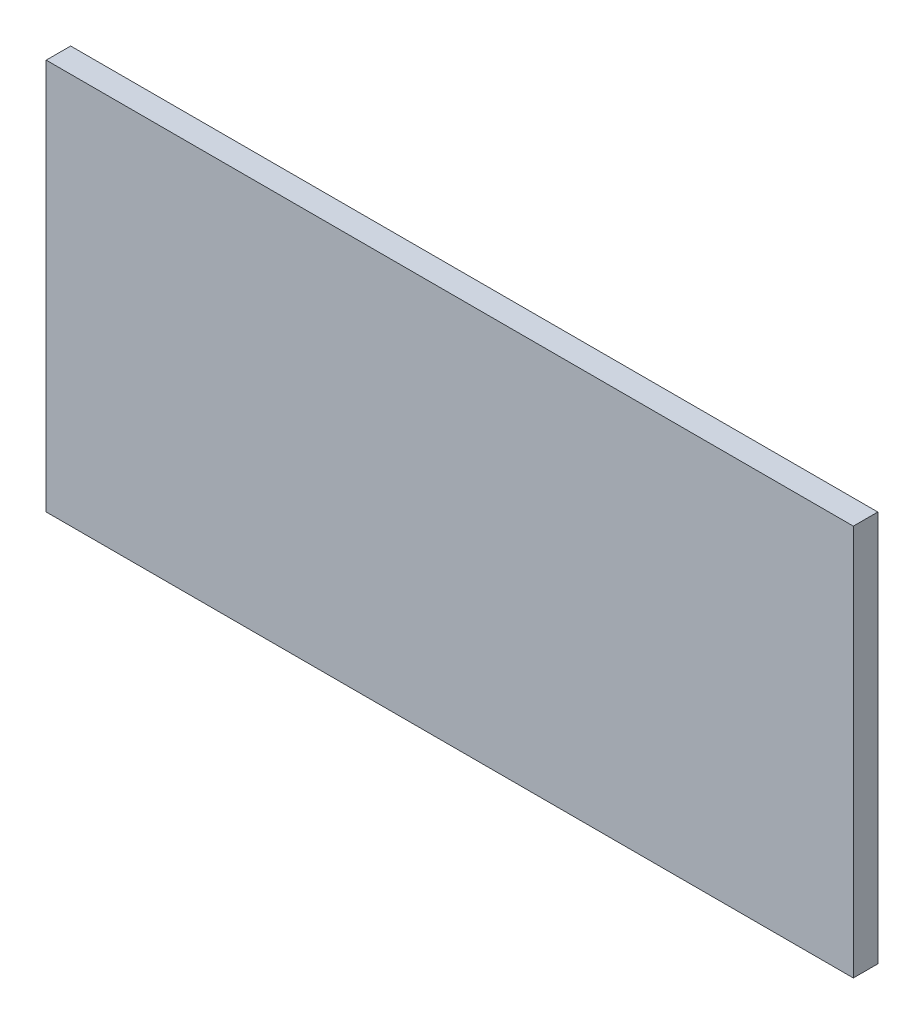
ISO-10303-21;
HEADER;
FILE_DESCRIPTION(('STEP AP214'),'2;1');
FILE_NAME('part.step','',(''),(''),'','','');
FILE_SCHEMA(('AUTOMOTIVE_DESIGN { 1 0 10303 214 1 1 1 1 }'));
ENDSEC;
DATA;
#1=APPLICATION_CONTEXT('core data for automotive mechanical design processes');
#2=APPLICATION_PROTOCOL_DEFINITION('international standard','automotive_design',2000,#1);
#3=PRODUCT_CONTEXT('',#1,'mechanical');
#4=PRODUCT('Part','Part','',(#3));
#5=PRODUCT_RELATED_PRODUCT_CATEGORY('part','',(#4));
#6=PRODUCT_DEFINITION_FORMATION('','',#4);
#7=PRODUCT_DEFINITION_CONTEXT('part definition',#1,'design');
#8=PRODUCT_DEFINITION('design','',#6,#7);
#9=PRODUCT_DEFINITION_SHAPE('','',#8);
#10=(LENGTH_UNIT() NAMED_UNIT(*) SI_UNIT(.MILLI.,.METRE.));
#11=(NAMED_UNIT(*) PLANE_ANGLE_UNIT() SI_UNIT($,.RADIAN.));
#12=(NAMED_UNIT(*) SI_UNIT($,.STERADIAN.) SOLID_ANGLE_UNIT());
#13=UNCERTAINTY_MEASURE_WITH_UNIT(LENGTH_MEASURE(1.E-05),#10,'distance_accuracy_value','');
#14=(GEOMETRIC_REPRESENTATION_CONTEXT(3) GLOBAL_UNCERTAINTY_ASSIGNED_CONTEXT((#13)) GLOBAL_UNIT_ASSIGNED_CONTEXT((#10,
#11,#12)) REPRESENTATION_CONTEXT('',''));
#15=CARTESIAN_POINT('',(0.,0.,0.));
#16=DIRECTION('',(0.,0.,1.));
#17=DIRECTION('',(1.,0.,0.));
#18=AXIS2_PLACEMENT_3D('',#15,#16,#17);
#19=CARTESIAN_POINT('',(66.,0.,2.));
#20=DIRECTION('',(0.,-1.,0.));
#21=DIRECTION('',(1.,0.,0.));
#22=AXIS2_PLACEMENT_3D('',#19,#20,#21);
#23=PLANE('',#22);
#24=DIRECTION('',(-1.,0.,0.));
#25=VECTOR('',#24,1.);
#26=CARTESIAN_POINT('',(66.,0.,0.));
#27=LINE('',#26,#25);
#28=CARTESIAN_POINT('',(66.,0.,0.));
#29=VERTEX_POINT('',#28);
#30=CARTESIAN_POINT('',(0.,0.,0.));
#31=VERTEX_POINT('',#30);
#32=EDGE_CURVE('E56',#29,#31,#27,.T.);
#33=ORIENTED_EDGE('',*,*,#32,.F.);
#34=DIRECTION('',(0.,0.,-1.));
#35=VECTOR('',#34,1.);
#36=CARTESIAN_POINT('',(66.,0.,2.));
#37=LINE('',#36,#35);
#38=CARTESIAN_POINT('',(66.,0.,2.));
#39=VERTEX_POINT('',#38);
#40=EDGE_CURVE('E31',#39,#29,#37,.T.);
#41=ORIENTED_EDGE('',*,*,#40,.F.);
#42=DIRECTION('',(-1.,0.,0.));
#43=VECTOR('',#42,1.);
#44=CARTESIAN_POINT('',(66.,0.,2.));
#45=LINE('',#44,#43);
#46=CARTESIAN_POINT('',(0.,0.,2.));
#47=VERTEX_POINT('',#46);
#48=EDGE_CURVE('E58',#39,#47,#45,.T.);
#49=ORIENTED_EDGE('',*,*,#48,.T.);
#50=DIRECTION('',(0.,0.,-1.));
#51=VECTOR('',#50,1.);
#52=CARTESIAN_POINT('',(0.,0.,2.));
#53=LINE('',#52,#51);
#54=EDGE_CURVE('E11',#47,#31,#53,.T.);
#55=ORIENTED_EDGE('',*,*,#54,.T.);
#56=EDGE_LOOP('',(#33,#41,#49,#55));
#57=FACE_BOUND('',#56,.T.);
#58=ADVANCED_FACE('F17',(#57),#23,.T.);
#59=CARTESIAN_POINT('',(0.,0.,2.));
#60=DIRECTION('',(-1.,0.,0.));
#61=DIRECTION('',(0.,-1.,0.));
#62=AXIS2_PLACEMENT_3D('',#59,#60,#61);
#63=PLANE('',#62);
#64=DIRECTION('',(0.,1.,0.));
#65=VECTOR('',#64,1.);
#66=CARTESIAN_POINT('',(0.,0.,0.));
#67=LINE('',#66,#65);
#68=CARTESIAN_POINT('',(0.,32.,0.));
#69=VERTEX_POINT('',#68);
#70=EDGE_CURVE('E63',#31,#69,#67,.T.);
#71=ORIENTED_EDGE('',*,*,#70,.F.);
#72=ORIENTED_EDGE('',*,*,#54,.F.);
#73=DIRECTION('',(0.,1.,0.));
#74=VECTOR('',#73,1.);
#75=CARTESIAN_POINT('',(0.,0.,2.));
#76=LINE('',#75,#74);
#77=CARTESIAN_POINT('',(0.,32.,2.));
#78=VERTEX_POINT('',#77);
#79=EDGE_CURVE('E81',#47,#78,#76,.T.);
#80=ORIENTED_EDGE('',*,*,#79,.T.);
#81=DIRECTION('',(0.,0.,-1.));
#82=VECTOR('',#81,1.);
#83=CARTESIAN_POINT('',(0.,32.,2.));
#84=LINE('',#83,#82);
#85=EDGE_CURVE('E24',#78,#69,#84,.T.);
#86=ORIENTED_EDGE('',*,*,#85,.T.);
#87=EDGE_LOOP('',(#71,#72,#80,#86));
#88=FACE_BOUND('',#87,.T.);
#89=ADVANCED_FACE('F64',(#88),#63,.T.);
#90=CARTESIAN_POINT('',(0.,32.,2.));
#91=DIRECTION('',(0.,1.,0.));
#92=DIRECTION('',(0.,0.,1.));
#93=AXIS2_PLACEMENT_3D('',#90,#91,#92);
#94=PLANE('',#93);
#95=DIRECTION('',(1.,0.,0.));
#96=VECTOR('',#95,1.);
#97=CARTESIAN_POINT('',(0.,32.,0.));
#98=LINE('',#97,#96);
#99=CARTESIAN_POINT('',(66.,32.,0.));
#100=VERTEX_POINT('',#99);
#101=EDGE_CURVE('E69',#69,#100,#98,.T.);
#102=ORIENTED_EDGE('',*,*,#101,.F.);
#103=ORIENTED_EDGE('',*,*,#85,.F.);
#104=DIRECTION('',(1.,0.,0.));
#105=VECTOR('',#104,1.);
#106=CARTESIAN_POINT('',(0.,32.,2.));
#107=LINE('',#106,#105);
#108=CARTESIAN_POINT('',(66.,32.,2.));
#109=VERTEX_POINT('',#108);
#110=EDGE_CURVE('E83',#78,#109,#107,.T.);
#111=ORIENTED_EDGE('',*,*,#110,.T.);
#112=DIRECTION('',(0.,0.,-1.));
#113=VECTOR('',#112,1.);
#114=CARTESIAN_POINT('',(66.,32.,2.));
#115=LINE('',#114,#113);
#116=EDGE_CURVE('E38',#109,#100,#115,.T.);
#117=ORIENTED_EDGE('',*,*,#116,.T.);
#118=EDGE_LOOP('',(#102,#103,#111,#117));
#119=FACE_BOUND('',#118,.T.);
#120=ADVANCED_FACE('F90',(#119),#94,.T.);
#121=CARTESIAN_POINT('',(66.,32.,2.));
#122=DIRECTION('',(1.,0.,0.));
#123=DIRECTION('',(0.,0.,-1.));
#124=AXIS2_PLACEMENT_3D('',#121,#122,#123);
#125=PLANE('',#124);
#126=DIRECTION('',(0.,-1.,0.));
#127=VECTOR('',#126,1.);
#128=CARTESIAN_POINT('',(66.,32.,0.));
#129=LINE('',#128,#127);
#130=EDGE_CURVE('E73',#100,#29,#129,.T.);
#131=ORIENTED_EDGE('',*,*,#130,.F.);
#132=ORIENTED_EDGE('',*,*,#116,.F.);
#133=DIRECTION('',(0.,-1.,0.));
#134=VECTOR('',#133,1.);
#135=CARTESIAN_POINT('',(66.,32.,2.));
#136=LINE('',#135,#134);
#137=EDGE_CURVE('E85',#109,#39,#136,.T.);
#138=ORIENTED_EDGE('',*,*,#137,.T.);
#139=ORIENTED_EDGE('',*,*,#40,.T.);
#140=EDGE_LOOP('',(#131,#132,#138,#139));
#141=FACE_BOUND('',#140,.T.);
#142=ADVANCED_FACE('F93',(#141),#125,.T.);
#143=CARTESIAN_POINT('',(66.,0.,2.));
#144=DIRECTION('',(0.,0.,1.));
#145=DIRECTION('',(1.,0.,0.));
#146=AXIS2_PLACEMENT_3D('',#143,#144,#145);
#147=PLANE('',#146);
#148=ORIENTED_EDGE('',*,*,#48,.F.);
#149=ORIENTED_EDGE('',*,*,#137,.F.);
#150=ORIENTED_EDGE('',*,*,#110,.F.);
#151=ORIENTED_EDGE('',*,*,#79,.F.);
#152=EDGE_LOOP('',(#148,#149,#150,#151));
#153=FACE_BOUND('',#152,.T.);
#154=ADVANCED_FACE('F102',(#153),#147,.T.);
#155=CARTESIAN_POINT('',(66.,0.,0.));
#156=DIRECTION('',(0.,0.,1.));
#157=DIRECTION('',(1.,0.,0.));
#158=AXIS2_PLACEMENT_3D('',#155,#156,#157);
#159=PLANE('',#158);
#160=ORIENTED_EDGE('',*,*,#32,.T.);
#161=ORIENTED_EDGE('',*,*,#70,.T.);
#162=ORIENTED_EDGE('',*,*,#101,.T.);
#163=ORIENTED_EDGE('',*,*,#130,.T.);
#164=EDGE_LOOP('',(#160,#161,#162,#163));
#165=FACE_BOUND('',#164,.T.);
#166=ADVANCED_FACE('F72',(#165),#159,.F.);
#167=CLOSED_SHELL('',(#58,#89,#120,#142,#154,#166));
#168=MANIFOLD_SOLID_BREP('B1',#167);
#169=ADVANCED_BREP_SHAPE_REPRESENTATION('',(#18,#168),#14);
#170=SHAPE_DEFINITION_REPRESENTATION(#9,#169);
ENDSEC;
END-ISO-10303-21;
